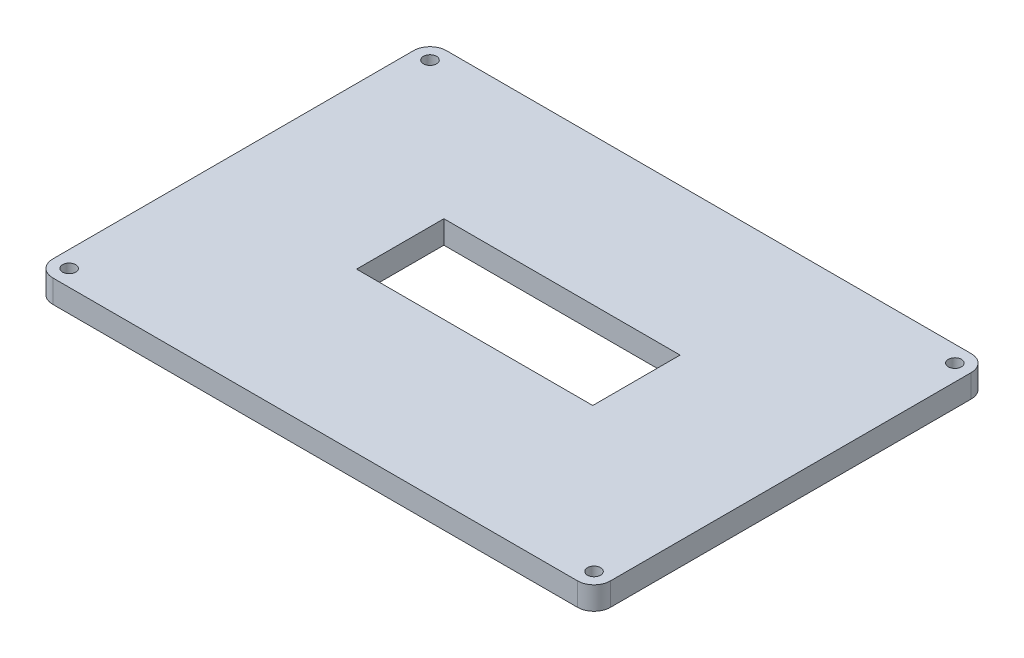
ISO-10303-21;
HEADER;
FILE_DESCRIPTION(('STEP AP214'),'2;1');
FILE_NAME('part.step','',(''),(''),'','','');
FILE_SCHEMA(('AUTOMOTIVE_DESIGN { 1 0 10303 214 1 1 1 1 }'));
ENDSEC;
DATA;
#1=APPLICATION_CONTEXT('core data for automotive mechanical design processes');
#2=APPLICATION_PROTOCOL_DEFINITION('international standard','automotive_design',2000,#1);
#3=PRODUCT_CONTEXT('',#1,'mechanical');
#4=PRODUCT('Part','Part','',(#3));
#5=PRODUCT_RELATED_PRODUCT_CATEGORY('part','',(#4));
#6=PRODUCT_DEFINITION_FORMATION('','',#4);
#7=PRODUCT_DEFINITION_CONTEXT('part definition',#1,'design');
#8=PRODUCT_DEFINITION('design','',#6,#7);
#9=PRODUCT_DEFINITION_SHAPE('','',#8);
#10=(LENGTH_UNIT() NAMED_UNIT(*) SI_UNIT(.MILLI.,.METRE.));
#11=(NAMED_UNIT(*) PLANE_ANGLE_UNIT() SI_UNIT($,.RADIAN.));
#12=(NAMED_UNIT(*) SI_UNIT($,.STERADIAN.) SOLID_ANGLE_UNIT());
#13=UNCERTAINTY_MEASURE_WITH_UNIT(LENGTH_MEASURE(1.E-05),#10,'distance_accuracy_value','');
#14=(GEOMETRIC_REPRESENTATION_CONTEXT(3) GLOBAL_UNCERTAINTY_ASSIGNED_CONTEXT((#13)) GLOBAL_UNIT_ASSIGNED_CONTEXT((#10,
#11,#12)) REPRESENTATION_CONTEXT('',''));
#15=CARTESIAN_POINT('',(0.,0.,0.));
#16=DIRECTION('',(0.,0.,1.));
#17=DIRECTION('',(1.,0.,0.));
#18=AXIS2_PLACEMENT_3D('',#15,#16,#17);
#19=CARTESIAN_POINT('',(-85.,7.,60.));
#20=DIRECTION('',(1.,0.,0.));
#21=DIRECTION('',(0.,0.,-1.));
#22=AXIS2_PLACEMENT_3D('',#19,#20,#21);
#23=PLANE('',#22);
#24=DIRECTION('',(0.,0.,1.));
#25=VECTOR('',#24,1.);
#26=CARTESIAN_POINT('',(-85.,0.,60.));
#27=LINE('',#26,#25);
#28=CARTESIAN_POINT('',(-85.,0.,-55.));
#29=VERTEX_POINT('',#28);
#30=CARTESIAN_POINT('',(-85.,0.,55.));
#31=VERTEX_POINT('',#30);
#32=EDGE_CURVE('E183',#29,#31,#27,.T.);
#33=ORIENTED_EDGE('',*,*,#32,.T.);
#34=DIRECTION('',(0.,-1.,0.));
#35=VECTOR('',#34,1.);
#36=CARTESIAN_POINT('',(-85.,7.,55.));
#37=LINE('',#36,#35);
#38=CARTESIAN_POINT('',(-85.,7.,55.));
#39=VERTEX_POINT('',#38);
#40=EDGE_CURVE('E11',#31,#39,#37,.F.);
#41=ORIENTED_EDGE('',*,*,#40,.T.);
#42=DIRECTION('',(0.,0.,1.));
#43=VECTOR('',#42,1.);
#44=CARTESIAN_POINT('',(-85.,7.,60.));
#45=LINE('',#44,#43);
#46=CARTESIAN_POINT('',(-85.,7.,-55.));
#47=VERTEX_POINT('',#46);
#48=EDGE_CURVE('E189',#47,#39,#45,.T.);
#49=ORIENTED_EDGE('',*,*,#48,.F.);
#50=DIRECTION('',(0.,-1.,0.));
#51=VECTOR('',#50,1.);
#52=CARTESIAN_POINT('',(-85.,7.,-55.));
#53=LINE('',#52,#51);
#54=EDGE_CURVE('E47',#47,#29,#53,.T.);
#55=ORIENTED_EDGE('',*,*,#54,.T.);
#56=EDGE_LOOP('',(#33,#41,#49,#55));
#57=FACE_BOUND('',#56,.T.);
#58=ADVANCED_FACE('F38',(#57),#23,.F.);
#59=CARTESIAN_POINT('',(85.,7.,60.));
#60=DIRECTION('',(0.,0.,-1.));
#61=DIRECTION('',(-1.,0.,0.));
#62=AXIS2_PLACEMENT_3D('',#59,#60,#61);
#63=PLANE('',#62);
#64=DIRECTION('',(1.,0.,0.));
#65=VECTOR('',#64,1.);
#66=CARTESIAN_POINT('',(85.,0.,60.));
#67=LINE('',#66,#65);
#68=CARTESIAN_POINT('',(-80.,0.,60.));
#69=VERTEX_POINT('',#68);
#70=CARTESIAN_POINT('',(80.,0.,60.));
#71=VERTEX_POINT('',#70);
#72=EDGE_CURVE('E208',#69,#71,#67,.T.);
#73=ORIENTED_EDGE('',*,*,#72,.T.);
#74=DIRECTION('',(0.,-1.,0.));
#75=VECTOR('',#74,1.);
#76=CARTESIAN_POINT('',(80.,7.,60.));
#77=LINE('',#76,#75);
#78=CARTESIAN_POINT('',(80.,7.,60.));
#79=VERTEX_POINT('',#78);
#80=EDGE_CURVE('E54',#71,#79,#77,.F.);
#81=ORIENTED_EDGE('',*,*,#80,.T.);
#82=DIRECTION('',(1.,0.,0.));
#83=VECTOR('',#82,1.);
#84=CARTESIAN_POINT('',(85.,7.,60.));
#85=LINE('',#84,#83);
#86=CARTESIAN_POINT('',(-80.,7.,60.));
#87=VERTEX_POINT('',#86);
#88=EDGE_CURVE('E192',#87,#79,#85,.T.);
#89=ORIENTED_EDGE('',*,*,#88,.F.);
#90=DIRECTION('',(0.,-1.,0.));
#91=VECTOR('',#90,1.);
#92=CARTESIAN_POINT('',(-80.,7.,60.));
#93=LINE('',#92,#91);
#94=EDGE_CURVE('E269',#87,#69,#93,.T.);
#95=ORIENTED_EDGE('',*,*,#94,.T.);
#96=EDGE_LOOP('',(#73,#81,#89,#95));
#97=FACE_BOUND('',#96,.T.);
#98=ADVANCED_FACE('F288',(#97),#63,.F.);
#99=CARTESIAN_POINT('',(85.,7.,60.));
#100=DIRECTION('',(-1.,0.,0.));
#101=DIRECTION('',(0.,0.,1.));
#102=AXIS2_PLACEMENT_3D('',#99,#100,#101);
#103=PLANE('',#102);
#104=DIRECTION('',(0.,0.,-1.));
#105=VECTOR('',#104,1.);
#106=CARTESIAN_POINT('',(85.,0.,60.));
#107=LINE('',#106,#105);
#108=CARTESIAN_POINT('',(85.,0.,55.));
#109=VERTEX_POINT('',#108);
#110=CARTESIAN_POINT('',(85.,0.,-55.));
#111=VERTEX_POINT('',#110);
#112=EDGE_CURVE('E211',#109,#111,#107,.T.);
#113=ORIENTED_EDGE('',*,*,#112,.T.);
#114=DIRECTION('',(0.,-1.,0.));
#115=VECTOR('',#114,1.);
#116=CARTESIAN_POINT('',(85.,7.,-55.));
#117=LINE('',#116,#115);
#118=CARTESIAN_POINT('',(85.,7.,-55.));
#119=VERTEX_POINT('',#118);
#120=EDGE_CURVE('E255',#111,#119,#117,.F.);
#121=ORIENTED_EDGE('',*,*,#120,.T.);
#122=DIRECTION('',(0.,0.,-1.));
#123=VECTOR('',#122,1.);
#124=CARTESIAN_POINT('',(85.,7.,60.));
#125=LINE('',#124,#123);
#126=CARTESIAN_POINT('',(85.,7.,55.));
#127=VERTEX_POINT('',#126);
#128=EDGE_CURVE('E196',#127,#119,#125,.T.);
#129=ORIENTED_EDGE('',*,*,#128,.F.);
#130=DIRECTION('',(0.,-1.,0.));
#131=VECTOR('',#130,1.);
#132=CARTESIAN_POINT('',(85.,7.,55.));
#133=LINE('',#132,#131);
#134=EDGE_CURVE('E251',#127,#109,#133,.T.);
#135=ORIENTED_EDGE('',*,*,#134,.T.);
#136=EDGE_LOOP('',(#113,#121,#129,#135));
#137=FACE_BOUND('',#136,.T.);
#138=ADVANCED_FACE('F297',(#137),#103,.F.);
#139=CARTESIAN_POINT('',(85.,7.,-60.));
#140=DIRECTION('',(0.,0.,1.));
#141=DIRECTION('',(1.,0.,0.));
#142=AXIS2_PLACEMENT_3D('',#139,#140,#141);
#143=PLANE('',#142);
#144=DIRECTION('',(-1.,0.,0.));
#145=VECTOR('',#144,1.);
#146=CARTESIAN_POINT('',(85.,7.,-60.));
#147=LINE('',#146,#145);
#148=CARTESIAN_POINT('',(80.,7.,-60.));
#149=VERTEX_POINT('',#148);
#150=CARTESIAN_POINT('',(-80.,7.,-60.));
#151=VERTEX_POINT('',#150);
#152=EDGE_CURVE('E200',#149,#151,#147,.T.);
#153=ORIENTED_EDGE('',*,*,#152,.F.);
#154=DIRECTION('',(0.,-1.,0.));
#155=VECTOR('',#154,1.);
#156=CARTESIAN_POINT('',(80.,7.,-60.));
#157=LINE('',#156,#155);
#158=CARTESIAN_POINT('',(80.,0.,-60.));
#159=VERTEX_POINT('',#158);
#160=EDGE_CURVE('E235',#149,#159,#157,.T.);
#161=ORIENTED_EDGE('',*,*,#160,.T.);
#162=DIRECTION('',(-1.,0.,0.));
#163=VECTOR('',#162,1.);
#164=CARTESIAN_POINT('',(85.,0.,-60.));
#165=LINE('',#164,#163);
#166=CARTESIAN_POINT('',(-80.,0.,-60.));
#167=VERTEX_POINT('',#166);
#168=EDGE_CURVE('E193',#159,#167,#165,.T.);
#169=ORIENTED_EDGE('',*,*,#168,.T.);
#170=DIRECTION('',(0.,-1.,0.));
#171=VECTOR('',#170,1.);
#172=CARTESIAN_POINT('',(-80.,7.,-60.));
#173=LINE('',#172,#171);
#174=EDGE_CURVE('E204',#167,#151,#173,.F.);
#175=ORIENTED_EDGE('',*,*,#174,.T.);
#176=EDGE_LOOP('',(#153,#161,#169,#175));
#177=FACE_BOUND('',#176,.T.);
#178=ADVANCED_FACE('F305',(#177),#143,.F.);
#179=CARTESIAN_POINT('',(0.,7.,0.));
#180=DIRECTION('',(0.,1.,0.));
#181=DIRECTION('',(0.,0.,1.));
#182=AXIS2_PLACEMENT_3D('',#179,#180,#181);
#183=PLANE('',#182);
#184=CARTESIAN_POINT('',(80.,7.,55.));
#185=DIRECTION('',(0.,1.,0.));
#186=DIRECTION('',(0.,0.,1.));
#187=AXIS2_PLACEMENT_3D('',#184,#185,#186);
#188=CIRCLE('',#187,2.);
#189=CARTESIAN_POINT('',(80.,7.,57.));
#190=VERTEX_POINT('',#189);
#191=EDGE_CURVE('E232',#190,#190,#188,.T.);
#192=ORIENTED_EDGE('',*,*,#191,.F.);
#193=EDGE_LOOP('',(#192));
#194=FACE_BOUND('',#193,.T.);
#195=CARTESIAN_POINT('',(80.,7.,-55.));
#196=DIRECTION('',(0.,1.,0.));
#197=DIRECTION('',(0.,0.,1.));
#198=AXIS2_PLACEMENT_3D('',#195,#196,#197);
#199=CIRCLE('',#198,2.);
#200=CARTESIAN_POINT('',(80.,7.,-53.));
#201=VERTEX_POINT('',#200);
#202=EDGE_CURVE('E227',#201,#201,#199,.T.);
#203=ORIENTED_EDGE('',*,*,#202,.F.);
#204=EDGE_LOOP('',(#203));
#205=FACE_BOUND('',#204,.T.);
#206=CARTESIAN_POINT('',(-80.,7.,55.));
#207=DIRECTION('',(0.,1.,0.));
#208=DIRECTION('',(0.,0.,1.));
#209=AXIS2_PLACEMENT_3D('',#206,#207,#208);
#210=CIRCLE('',#209,2.);
#211=CARTESIAN_POINT('',(-80.,7.,57.));
#212=VERTEX_POINT('',#211);
#213=EDGE_CURVE('E222',#212,#212,#210,.T.);
#214=ORIENTED_EDGE('',*,*,#213,.F.);
#215=EDGE_LOOP('',(#214));
#216=FACE_BOUND('',#215,.T.);
#217=CARTESIAN_POINT('',(-80.,7.,-55.));
#218=DIRECTION('',(0.,1.,0.));
#219=DIRECTION('',(0.,0.,1.));
#220=AXIS2_PLACEMENT_3D('',#217,#218,#219);
#221=CIRCLE('',#220,2.);
#222=CARTESIAN_POINT('',(-80.,7.,-53.));
#223=VERTEX_POINT('',#222);
#224=EDGE_CURVE('E164',#223,#223,#221,.T.);
#225=ORIENTED_EDGE('',*,*,#224,.F.);
#226=EDGE_LOOP('',(#225));
#227=FACE_BOUND('',#226,.T.);
#228=DIRECTION('',(0.,0.,-1.));
#229=VECTOR('',#228,1.);
#230=CARTESIAN_POINT('',(36.,7.,-15.2367721667));
#231=LINE('',#230,#229);
#232=CARTESIAN_POINT('',(36.,7.,11.3837952969598));
#233=VERTEX_POINT('',#232);
#234=CARTESIAN_POINT('',(36.,7.,-15.2367721667));
#235=VERTEX_POINT('',#234);
#236=EDGE_CURVE('E136',#233,#235,#231,.T.);
#237=ORIENTED_EDGE('',*,*,#236,.F.);
#238=DIRECTION('',(1.,0.,0.));
#239=VECTOR('',#238,1.);
#240=CARTESIAN_POINT('',(-36.,7.,11.3837952969598));
#241=LINE('',#240,#239);
#242=CARTESIAN_POINT('',(-36.,7.,11.3837952969598));
#243=VERTEX_POINT('',#242);
#244=EDGE_CURVE('E157',#243,#233,#241,.T.);
#245=ORIENTED_EDGE('',*,*,#244,.F.);
#246=DIRECTION('',(0.,0.,1.));
#247=VECTOR('',#246,1.);
#248=CARTESIAN_POINT('',(-36.,7.,-15.2367721667));
#249=LINE('',#248,#247);
#250=CARTESIAN_POINT('',(-36.,7.,-15.2367721667));
#251=VERTEX_POINT('',#250);
#252=EDGE_CURVE('E161',#251,#243,#249,.T.);
#253=ORIENTED_EDGE('',*,*,#252,.F.);
#254=DIRECTION('',(-1.,0.,0.));
#255=VECTOR('',#254,1.);
#256=CARTESIAN_POINT('',(-36.,7.,-15.2367721667));
#257=LINE('',#256,#255);
#258=EDGE_CURVE('E173',#235,#251,#257,.T.);
#259=ORIENTED_EDGE('',*,*,#258,.F.);
#260=EDGE_LOOP('',(#237,#245,#253,#259));
#261=FACE_BOUND('',#260,.T.);
#262=ORIENTED_EDGE('',*,*,#128,.T.);
#263=CARTESIAN_POINT('',(80.,7.,-55.));
#264=DIRECTION('',(0.,1.,0.));
#265=DIRECTION('',(0.,0.,1.));
#266=AXIS2_PLACEMENT_3D('',#263,#264,#265);
#267=CIRCLE('',#266,5.);
#268=EDGE_CURVE('E266',#119,#149,#267,.T.);
#269=ORIENTED_EDGE('',*,*,#268,.T.);
#270=ORIENTED_EDGE('',*,*,#152,.T.);
#271=CARTESIAN_POINT('',(-80.,7.,-55.));
#272=DIRECTION('',(0.,1.,0.));
#273=DIRECTION('',(0.,0.,1.));
#274=AXIS2_PLACEMENT_3D('',#271,#272,#273);
#275=CIRCLE('',#274,5.);
#276=EDGE_CURVE('E258',#151,#47,#275,.T.);
#277=ORIENTED_EDGE('',*,*,#276,.T.);
#278=ORIENTED_EDGE('',*,*,#48,.T.);
#279=CARTESIAN_POINT('',(-80.,7.,55.));
#280=DIRECTION('',(0.,1.,0.));
#281=DIRECTION('',(0.,0.,1.));
#282=AXIS2_PLACEMENT_3D('',#279,#280,#281);
#283=CIRCLE('',#282,5.);
#284=EDGE_CURVE('E61',#39,#87,#283,.T.);
#285=ORIENTED_EDGE('',*,*,#284,.T.);
#286=ORIENTED_EDGE('',*,*,#88,.T.);
#287=CARTESIAN_POINT('',(80.,7.,55.));
#288=DIRECTION('',(0.,1.,0.));
#289=DIRECTION('',(0.,0.,1.));
#290=AXIS2_PLACEMENT_3D('',#287,#288,#289);
#291=CIRCLE('',#290,5.);
#292=EDGE_CURVE('E263',#79,#127,#291,.T.);
#293=ORIENTED_EDGE('',*,*,#292,.T.);
#294=EDGE_LOOP('',(#262,#269,#270,#277,#278,#285,#286,#293));
#295=FACE_BOUND('',#294,.T.);
#296=ADVANCED_FACE('F290',(#194,#205,#216,#227,#261,#295),#183,.T.);
#297=CARTESIAN_POINT('',(0.,0.,0.));
#298=DIRECTION('',(0.,1.,0.));
#299=DIRECTION('',(0.,0.,1.));
#300=AXIS2_PLACEMENT_3D('',#297,#298,#299);
#301=PLANE('',#300);
#302=CARTESIAN_POINT('',(80.,0.,55.));
#303=DIRECTION('',(0.,1.,0.));
#304=DIRECTION('',(0.,0.,1.));
#305=AXIS2_PLACEMENT_3D('',#302,#303,#304);
#306=CIRCLE('',#305,2.);
#307=CARTESIAN_POINT('',(80.,0.,57.));
#308=VERTEX_POINT('',#307);
#309=EDGE_CURVE('E228',#308,#308,#306,.T.);
#310=ORIENTED_EDGE('',*,*,#309,.T.);
#311=EDGE_LOOP('',(#310));
#312=FACE_BOUND('',#311,.T.);
#313=CARTESIAN_POINT('',(80.,0.,-55.));
#314=DIRECTION('',(0.,1.,0.));
#315=DIRECTION('',(0.,0.,1.));
#316=AXIS2_PLACEMENT_3D('',#313,#314,#315);
#317=CIRCLE('',#316,2.);
#318=CARTESIAN_POINT('',(80.,0.,-53.));
#319=VERTEX_POINT('',#318);
#320=EDGE_CURVE('E223',#319,#319,#317,.T.);
#321=ORIENTED_EDGE('',*,*,#320,.T.);
#322=EDGE_LOOP('',(#321));
#323=FACE_BOUND('',#322,.T.);
#324=CARTESIAN_POINT('',(-80.,0.,55.));
#325=DIRECTION('',(0.,1.,0.));
#326=DIRECTION('',(0.,0.,1.));
#327=AXIS2_PLACEMENT_3D('',#324,#325,#326);
#328=CIRCLE('',#327,2.);
#329=CARTESIAN_POINT('',(-80.,0.,57.));
#330=VERTEX_POINT('',#329);
#331=EDGE_CURVE('E218',#330,#330,#328,.T.);
#332=ORIENTED_EDGE('',*,*,#331,.T.);
#333=EDGE_LOOP('',(#332));
#334=FACE_BOUND('',#333,.T.);
#335=CARTESIAN_POINT('',(-80.,0.,-55.));
#336=DIRECTION('',(0.,1.,0.));
#337=DIRECTION('',(0.,0.,1.));
#338=AXIS2_PLACEMENT_3D('',#335,#336,#337);
#339=CIRCLE('',#338,2.);
#340=CARTESIAN_POINT('',(-80.,0.,-53.));
#341=VERTEX_POINT('',#340);
#342=EDGE_CURVE('E174',#341,#341,#339,.T.);
#343=ORIENTED_EDGE('',*,*,#342,.T.);
#344=EDGE_LOOP('',(#343));
#345=FACE_BOUND('',#344,.T.);
#346=DIRECTION('',(1.,0.,0.));
#347=VECTOR('',#346,1.);
#348=CARTESIAN_POINT('',(-36.,0.,11.3837952969598));
#349=LINE('',#348,#347);
#350=CARTESIAN_POINT('',(-36.,0.,11.3837952969598));
#351=VERTEX_POINT('',#350);
#352=CARTESIAN_POINT('',(36.,0.,11.3837952969598));
#353=VERTEX_POINT('',#352);
#354=EDGE_CURVE('E142',#351,#353,#349,.T.);
#355=ORIENTED_EDGE('',*,*,#354,.T.);
#356=DIRECTION('',(0.,0.,-1.));
#357=VECTOR('',#356,1.);
#358=CARTESIAN_POINT('',(36.,0.,-15.2367721667));
#359=LINE('',#358,#357);
#360=CARTESIAN_POINT('',(36.,0.,-15.2367721667));
#361=VERTEX_POINT('',#360);
#362=EDGE_CURVE('E133',#353,#361,#359,.T.);
#363=ORIENTED_EDGE('',*,*,#362,.T.);
#364=DIRECTION('',(-1.,0.,0.));
#365=VECTOR('',#364,1.);
#366=CARTESIAN_POINT('',(-36.,0.,-15.2367721667));
#367=LINE('',#366,#365);
#368=CARTESIAN_POINT('',(-36.,0.,-15.2367721667));
#369=VERTEX_POINT('',#368);
#370=EDGE_CURVE('E146',#361,#369,#367,.T.);
#371=ORIENTED_EDGE('',*,*,#370,.T.);
#372=DIRECTION('',(0.,0.,1.));
#373=VECTOR('',#372,1.);
#374=CARTESIAN_POINT('',(-36.,0.,-15.2367721667));
#375=LINE('',#374,#373);
#376=EDGE_CURVE('E151',#369,#351,#375,.T.);
#377=ORIENTED_EDGE('',*,*,#376,.T.);
#378=EDGE_LOOP('',(#355,#363,#371,#377));
#379=FACE_BOUND('',#378,.T.);
#380=ORIENTED_EDGE('',*,*,#168,.F.);
#381=CARTESIAN_POINT('',(80.,0.,-55.));
#382=DIRECTION('',(0.,1.,0.));
#383=DIRECTION('',(0.,0.,1.));
#384=AXIS2_PLACEMENT_3D('',#381,#382,#383);
#385=CIRCLE('',#384,5.);
#386=EDGE_CURVE('E248',#159,#111,#385,.F.);
#387=ORIENTED_EDGE('',*,*,#386,.T.);
#388=ORIENTED_EDGE('',*,*,#112,.F.);
#389=CARTESIAN_POINT('',(80.,0.,55.));
#390=DIRECTION('',(0.,1.,0.));
#391=DIRECTION('',(0.,0.,1.));
#392=AXIS2_PLACEMENT_3D('',#389,#390,#391);
#393=CIRCLE('',#392,5.);
#394=EDGE_CURVE('E245',#109,#71,#393,.F.);
#395=ORIENTED_EDGE('',*,*,#394,.T.);
#396=ORIENTED_EDGE('',*,*,#72,.F.);
#397=CARTESIAN_POINT('',(-80.,0.,55.));
#398=DIRECTION('',(0.,1.,0.));
#399=DIRECTION('',(0.,0.,1.));
#400=AXIS2_PLACEMENT_3D('',#397,#398,#399);
#401=CIRCLE('',#400,5.);
#402=EDGE_CURVE('E242',#69,#31,#401,.F.);
#403=ORIENTED_EDGE('',*,*,#402,.T.);
#404=ORIENTED_EDGE('',*,*,#32,.F.);
#405=CARTESIAN_POINT('',(-80.,0.,-55.));
#406=DIRECTION('',(0.,1.,0.));
#407=DIRECTION('',(0.,0.,1.));
#408=AXIS2_PLACEMENT_3D('',#405,#406,#407);
#409=CIRCLE('',#408,5.);
#410=EDGE_CURVE('E239',#29,#167,#409,.F.);
#411=ORIENTED_EDGE('',*,*,#410,.T.);
#412=EDGE_LOOP('',(#380,#387,#388,#395,#396,#403,#404,#411));
#413=FACE_BOUND('',#412,.T.);
#414=ADVANCED_FACE('F153',(#312,#323,#334,#345,#379,#413),#301,.F.);
#415=CARTESIAN_POINT('',(36.,0.,-15.2367721667));
#416=DIRECTION('',(1.,0.,0.));
#417=DIRECTION('',(0.,0.,-1.));
#418=AXIS2_PLACEMENT_3D('',#415,#416,#417);
#419=PLANE('',#418);
#420=ORIENTED_EDGE('',*,*,#236,.T.);
#421=DIRECTION('',(0.,1.,0.));
#422=VECTOR('',#421,1.);
#423=CARTESIAN_POINT('',(36.,0.,-15.2367721667));
#424=LINE('',#423,#422);
#425=EDGE_CURVE('E129',#361,#235,#424,.T.);
#426=ORIENTED_EDGE('',*,*,#425,.F.);
#427=ORIENTED_EDGE('',*,*,#362,.F.);
#428=DIRECTION('',(0.,1.,0.));
#429=VECTOR('',#428,1.);
#430=CARTESIAN_POINT('',(36.,0.,11.3837952969598));
#431=LINE('',#430,#429);
#432=EDGE_CURVE('E180',#353,#233,#431,.T.);
#433=ORIENTED_EDGE('',*,*,#432,.T.);
#434=EDGE_LOOP('',(#420,#426,#427,#433));
#435=FACE_BOUND('',#434,.T.);
#436=ADVANCED_FACE('F131',(#435),#419,.F.);
#437=CARTESIAN_POINT('',(-36.,0.,11.3837952969598));
#438=DIRECTION('',(0.,0.,1.));
#439=DIRECTION('',(1.,0.,0.));
#440=AXIS2_PLACEMENT_3D('',#437,#438,#439);
#441=PLANE('',#440);
#442=ORIENTED_EDGE('',*,*,#244,.T.);
#443=ORIENTED_EDGE('',*,*,#432,.F.);
#444=ORIENTED_EDGE('',*,*,#354,.F.);
#445=DIRECTION('',(0.,1.,0.));
#446=VECTOR('',#445,1.);
#447=CARTESIAN_POINT('',(-36.,0.,11.3837952969598));
#448=LINE('',#447,#446);
#449=EDGE_CURVE('E184',#351,#243,#448,.T.);
#450=ORIENTED_EDGE('',*,*,#449,.T.);
#451=EDGE_LOOP('',(#442,#443,#444,#450));
#452=FACE_BOUND('',#451,.T.);
#453=ADVANCED_FACE('F395',(#452),#441,.F.);
#454=CARTESIAN_POINT('',(-36.,0.,-15.2367721667));
#455=DIRECTION('',(-1.,0.,0.));
#456=DIRECTION('',(0.,0.,1.));
#457=AXIS2_PLACEMENT_3D('',#454,#455,#456);
#458=PLANE('',#457);
#459=ORIENTED_EDGE('',*,*,#252,.T.);
#460=ORIENTED_EDGE('',*,*,#449,.F.);
#461=ORIENTED_EDGE('',*,*,#376,.F.);
#462=DIRECTION('',(0.,1.,0.));
#463=VECTOR('',#462,1.);
#464=CARTESIAN_POINT('',(-36.,0.,-15.2367721667));
#465=LINE('',#464,#463);
#466=EDGE_CURVE('E141',#369,#251,#465,.T.);
#467=ORIENTED_EDGE('',*,*,#466,.T.);
#468=EDGE_LOOP('',(#459,#460,#461,#467));
#469=FACE_BOUND('',#468,.T.);
#470=ADVANCED_FACE('F387',(#469),#458,.F.);
#471=CARTESIAN_POINT('',(-36.,0.,-15.2367721667));
#472=DIRECTION('',(0.,0.,-1.));
#473=DIRECTION('',(-1.,0.,0.));
#474=AXIS2_PLACEMENT_3D('',#471,#472,#473);
#475=PLANE('',#474);
#476=ORIENTED_EDGE('',*,*,#258,.T.);
#477=ORIENTED_EDGE('',*,*,#466,.F.);
#478=ORIENTED_EDGE('',*,*,#370,.F.);
#479=ORIENTED_EDGE('',*,*,#425,.T.);
#480=EDGE_LOOP('',(#476,#477,#478,#479));
#481=FACE_BOUND('',#480,.T.);
#482=ADVANCED_FACE('F147',(#481),#475,.F.);
#483=CARTESIAN_POINT('',(-80.,0.,-55.));
#484=DIRECTION('',(0.,1.,0.));
#485=DIRECTION('',(0.,0.,1.));
#486=AXIS2_PLACEMENT_3D('',#483,#484,#485);
#487=CYLINDRICAL_SURFACE('',#486,2.);
#488=ORIENTED_EDGE('',*,*,#342,.F.);
#489=EDGE_LOOP('',(#488));
#490=FACE_BOUND('',#489,.T.);
#491=ORIENTED_EDGE('',*,*,#224,.T.);
#492=EDGE_LOOP('',(#491));
#493=FACE_BOUND('',#492,.T.);
#494=ADVANCED_FACE('F370',(#490,#493),#487,.F.);
#495=CARTESIAN_POINT('',(-80.,-3.,55.));
#496=DIRECTION('',(0.,1.,0.));
#497=DIRECTION('',(0.,0.,1.));
#498=AXIS2_PLACEMENT_3D('',#495,#496,#497);
#499=CYLINDRICAL_SURFACE('',#498,2.);
#500=ORIENTED_EDGE('',*,*,#213,.T.);
#501=EDGE_LOOP('',(#500));
#502=FACE_BOUND('',#501,.T.);
#503=ORIENTED_EDGE('',*,*,#331,.F.);
#504=EDGE_LOOP('',(#503));
#505=FACE_BOUND('',#504,.T.);
#506=ADVANCED_FACE('F361',(#502,#505),#499,.F.);
#507=CARTESIAN_POINT('',(80.,-3.,-55.));
#508=DIRECTION('',(0.,1.,0.));
#509=DIRECTION('',(0.,0.,1.));
#510=AXIS2_PLACEMENT_3D('',#507,#508,#509);
#511=CYLINDRICAL_SURFACE('',#510,2.);
#512=ORIENTED_EDGE('',*,*,#202,.T.);
#513=EDGE_LOOP('',(#512));
#514=FACE_BOUND('',#513,.T.);
#515=ORIENTED_EDGE('',*,*,#320,.F.);
#516=EDGE_LOOP('',(#515));
#517=FACE_BOUND('',#516,.T.);
#518=ADVANCED_FACE('F352',(#514,#517),#511,.F.);
#519=CARTESIAN_POINT('',(80.,-3.,55.));
#520=DIRECTION('',(0.,1.,0.));
#521=DIRECTION('',(0.,0.,1.));
#522=AXIS2_PLACEMENT_3D('',#519,#520,#521);
#523=CYLINDRICAL_SURFACE('',#522,2.);
#524=ORIENTED_EDGE('',*,*,#191,.T.);
#525=EDGE_LOOP('',(#524));
#526=FACE_BOUND('',#525,.T.);
#527=ORIENTED_EDGE('',*,*,#309,.F.);
#528=EDGE_LOOP('',(#527));
#529=FACE_BOUND('',#528,.T.);
#530=ADVANCED_FACE('F321',(#526,#529),#523,.F.);
#531=CARTESIAN_POINT('',(80.,7.,-55.));
#532=DIRECTION('',(0.,-1.,0.));
#533=DIRECTION('',(0.,0.,-1.));
#534=AXIS2_PLACEMENT_3D('',#531,#532,#533);
#535=CYLINDRICAL_SURFACE('',#534,5.);
#536=ORIENTED_EDGE('',*,*,#268,.F.);
#537=ORIENTED_EDGE('',*,*,#120,.F.);
#538=ORIENTED_EDGE('',*,*,#386,.F.);
#539=ORIENTED_EDGE('',*,*,#160,.F.);
#540=EDGE_LOOP('',(#536,#537,#538,#539));
#541=FACE_BOUND('',#540,.T.);
#542=ADVANCED_FACE('F302',(#541),#535,.T.);
#543=CARTESIAN_POINT('',(80.,7.,55.));
#544=DIRECTION('',(0.,-1.,0.));
#545=DIRECTION('',(0.,0.,-1.));
#546=AXIS2_PLACEMENT_3D('',#543,#544,#545);
#547=CYLINDRICAL_SURFACE('',#546,5.);
#548=ORIENTED_EDGE('',*,*,#292,.F.);
#549=ORIENTED_EDGE('',*,*,#80,.F.);
#550=ORIENTED_EDGE('',*,*,#394,.F.);
#551=ORIENTED_EDGE('',*,*,#134,.F.);
#552=EDGE_LOOP('',(#548,#549,#550,#551));
#553=FACE_BOUND('',#552,.T.);
#554=ADVANCED_FACE('F294',(#553),#547,.T.);
#555=CARTESIAN_POINT('',(-80.,7.,55.));
#556=DIRECTION('',(0.,-1.,0.));
#557=DIRECTION('',(0.,0.,-1.));
#558=AXIS2_PLACEMENT_3D('',#555,#556,#557);
#559=CYLINDRICAL_SURFACE('',#558,5.);
#560=ORIENTED_EDGE('',*,*,#284,.F.);
#561=ORIENTED_EDGE('',*,*,#40,.F.);
#562=ORIENTED_EDGE('',*,*,#402,.F.);
#563=ORIENTED_EDGE('',*,*,#94,.F.);
#564=EDGE_LOOP('',(#560,#561,#562,#563));
#565=FACE_BOUND('',#564,.T.);
#566=ADVANCED_FACE('F287',(#565),#559,.T.);
#567=CARTESIAN_POINT('',(-80.,7.,-55.));
#568=DIRECTION('',(0.,-1.,0.));
#569=DIRECTION('',(0.,0.,-1.));
#570=AXIS2_PLACEMENT_3D('',#567,#568,#569);
#571=CYLINDRICAL_SURFACE('',#570,5.);
#572=ORIENTED_EDGE('',*,*,#276,.F.);
#573=ORIENTED_EDGE('',*,*,#174,.F.);
#574=ORIENTED_EDGE('',*,*,#410,.F.);
#575=ORIENTED_EDGE('',*,*,#54,.F.);
#576=EDGE_LOOP('',(#572,#573,#574,#575));
#577=FACE_BOUND('',#576,.T.);
#578=ADVANCED_FACE('F40',(#577),#571,.T.);
#579=CLOSED_SHELL('',(#58,#98,#138,#178,#296,#414,#436,#453,#470,#482,#494,#506,#518,#530,#542,
#554,#566,#578));
#580=MANIFOLD_SOLID_BREP('B2',#579);
#581=ADVANCED_BREP_SHAPE_REPRESENTATION('',(#18,#580),#14);
#582=SHAPE_DEFINITION_REPRESENTATION(#9,#581);
ENDSEC;
END-ISO-10303-21;
